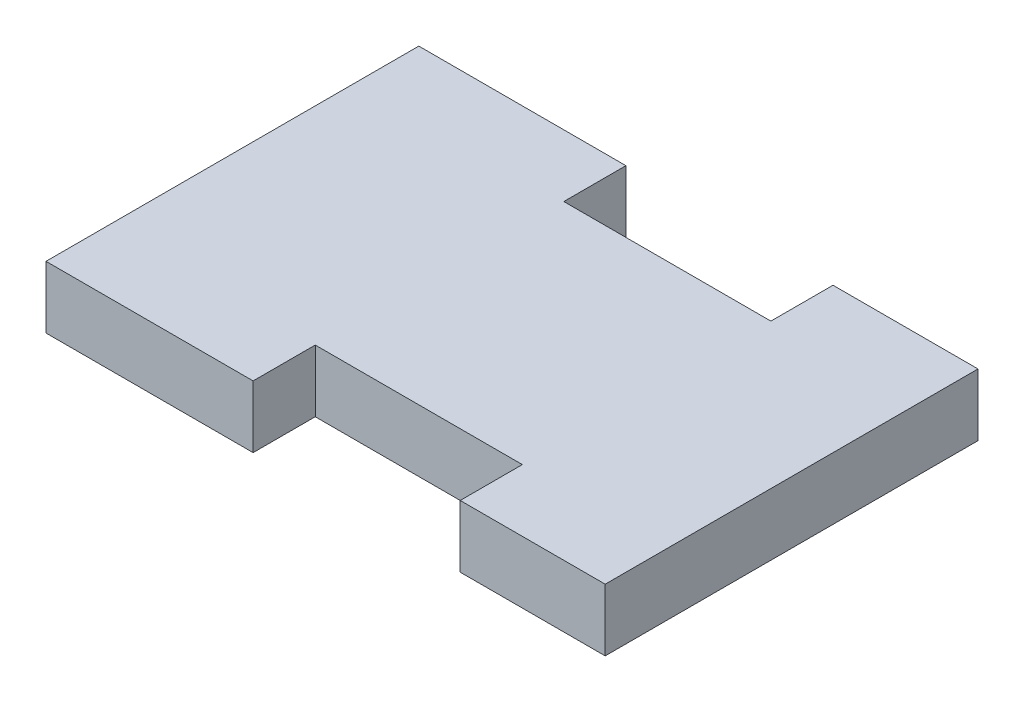
ISO-10303-21;
HEADER;
FILE_DESCRIPTION(('STEP AP214'),'2;1');
FILE_NAME('part.step','',(''),(''),'','','');
FILE_SCHEMA(('AUTOMOTIVE_DESIGN { 1 0 10303 214 1 1 1 1 }'));
ENDSEC;
DATA;
#1=APPLICATION_CONTEXT('core data for automotive mechanical design processes');
#2=APPLICATION_PROTOCOL_DEFINITION('international standard','automotive_design',2000,#1);
#3=PRODUCT_CONTEXT('',#1,'mechanical');
#4=PRODUCT('Part','Part','',(#3));
#5=PRODUCT_RELATED_PRODUCT_CATEGORY('part','',(#4));
#6=PRODUCT_DEFINITION_FORMATION('','',#4);
#7=PRODUCT_DEFINITION_CONTEXT('part definition',#1,'design');
#8=PRODUCT_DEFINITION('design','',#6,#7);
#9=PRODUCT_DEFINITION_SHAPE('','',#8);
#10=(LENGTH_UNIT() NAMED_UNIT(*) SI_UNIT(.MILLI.,.METRE.));
#11=(NAMED_UNIT(*) PLANE_ANGLE_UNIT() SI_UNIT($,.RADIAN.));
#12=(NAMED_UNIT(*) SI_UNIT($,.STERADIAN.) SOLID_ANGLE_UNIT());
#13=UNCERTAINTY_MEASURE_WITH_UNIT(LENGTH_MEASURE(1.E-05),#10,'distance_accuracy_value','');
#14=(GEOMETRIC_REPRESENTATION_CONTEXT(3) GLOBAL_UNCERTAINTY_ASSIGNED_CONTEXT((#13)) GLOBAL_UNIT_ASSIGNED_CONTEXT((#10,
#11,#12)) REPRESENTATION_CONTEXT('',''));
#15=CARTESIAN_POINT('',(0.,0.,0.));
#16=DIRECTION('',(0.,0.,1.));
#17=DIRECTION('',(1.,0.,0.));
#18=AXIS2_PLACEMENT_3D('',#15,#16,#17);
#19=CARTESIAN_POINT('',(0.,3.,0.));
#20=DIRECTION('',(1.,0.,0.));
#21=DIRECTION('',(0.,0.,-1.));
#22=AXIS2_PLACEMENT_3D('',#19,#20,#21);
#23=PLANE('',#22);
#24=DIRECTION('',(0.,0.,1.));
#25=VECTOR('',#24,1.);
#26=CARTESIAN_POINT('',(0.,0.,0.));
#27=LINE('',#26,#25);
#28=CARTESIAN_POINT('',(0.,0.,-17.999964));
#29=VERTEX_POINT('',#28);
#30=CARTESIAN_POINT('',(0.,0.,0.));
#31=VERTEX_POINT('',#30);
#32=EDGE_CURVE('E152',#29,#31,#27,.T.);
#33=ORIENTED_EDGE('',*,*,#32,.T.);
#34=DIRECTION('',(0.,-1.,0.));
#35=VECTOR('',#34,1.);
#36=CARTESIAN_POINT('',(0.,3.,0.));
#37=LINE('',#36,#35);
#38=CARTESIAN_POINT('',(0.,3.,0.));
#39=VERTEX_POINT('',#38);
#40=EDGE_CURVE('E11',#39,#31,#37,.T.);
#41=ORIENTED_EDGE('',*,*,#40,.F.);
#42=DIRECTION('',(0.,0.,1.));
#43=VECTOR('',#42,1.);
#44=CARTESIAN_POINT('',(0.,3.,0.));
#45=LINE('',#44,#43);
#46=CARTESIAN_POINT('',(0.,3.,-17.999964));
#47=VERTEX_POINT('',#46);
#48=EDGE_CURVE('E174',#47,#39,#45,.T.);
#49=ORIENTED_EDGE('',*,*,#48,.F.);
#50=DIRECTION('',(0.,-1.,0.));
#51=VECTOR('',#50,1.);
#52=CARTESIAN_POINT('',(0.,3.,-17.999964));
#53=LINE('',#52,#51);
#54=EDGE_CURVE('E148',#47,#29,#53,.T.);
#55=ORIENTED_EDGE('',*,*,#54,.T.);
#56=EDGE_LOOP('',(#33,#41,#49,#55));
#57=FACE_BOUND('',#56,.T.);
#58=ADVANCED_FACE('F32',(#57),#23,.F.);
#59=CARTESIAN_POINT('',(0.,3.,0.));
#60=DIRECTION('',(0.,0.,-1.));
#61=DIRECTION('',(-1.,0.,0.));
#62=AXIS2_PLACEMENT_3D('',#59,#60,#61);
#63=PLANE('',#62);
#64=DIRECTION('',(1.,0.,0.));
#65=VECTOR('',#64,1.);
#66=CARTESIAN_POINT('',(0.,0.,0.));
#67=LINE('',#66,#65);
#68=CARTESIAN_POINT('',(10.000234,0.,0.));
#69=VERTEX_POINT('',#68);
#70=EDGE_CURVE('E155',#31,#69,#67,.T.);
#71=ORIENTED_EDGE('',*,*,#70,.T.);
#72=DIRECTION('',(0.,-1.,0.));
#73=VECTOR('',#72,1.);
#74=CARTESIAN_POINT('',(10.000234,3.,0.));
#75=LINE('',#74,#73);
#76=CARTESIAN_POINT('',(10.000234,3.,0.));
#77=VERTEX_POINT('',#76);
#78=EDGE_CURVE('E40',#77,#69,#75,.T.);
#79=ORIENTED_EDGE('',*,*,#78,.F.);
#80=DIRECTION('',(1.,0.,0.));
#81=VECTOR('',#80,1.);
#82=CARTESIAN_POINT('',(0.,3.,0.));
#83=LINE('',#82,#81);
#84=EDGE_CURVE('E103',#39,#77,#83,.T.);
#85=ORIENTED_EDGE('',*,*,#84,.F.);
#86=ORIENTED_EDGE('',*,*,#40,.T.);
#87=EDGE_LOOP('',(#71,#79,#85,#86));
#88=FACE_BOUND('',#87,.T.);
#89=ADVANCED_FACE('F252',(#88),#63,.F.);
#90=CARTESIAN_POINT('',(10.000234,3.,-2.99999400000002));
#91=DIRECTION('',(-1.,0.,0.));
#92=DIRECTION('',(0.,0.,1.));
#93=AXIS2_PLACEMENT_3D('',#90,#91,#92);
#94=PLANE('',#93);
#95=DIRECTION('',(0.,0.,-1.));
#96=VECTOR('',#95,1.);
#97=CARTESIAN_POINT('',(10.000234,0.,-2.99999400000002));
#98=LINE('',#97,#96);
#99=CARTESIAN_POINT('',(10.000234,0.,-2.99999400000002));
#100=VERTEX_POINT('',#99);
#101=EDGE_CURVE('E157',#69,#100,#98,.T.);
#102=ORIENTED_EDGE('',*,*,#101,.T.);
#103=DIRECTION('',(0.,-1.,0.));
#104=VECTOR('',#103,1.);
#105=CARTESIAN_POINT('',(10.000234,3.,-2.99999400000002));
#106=LINE('',#105,#104);
#107=CARTESIAN_POINT('',(10.000234,3.,-2.99999400000002));
#108=VERTEX_POINT('',#107);
#109=EDGE_CURVE('E193',#108,#100,#106,.T.);
#110=ORIENTED_EDGE('',*,*,#109,.F.);
#111=DIRECTION('',(0.,0.,-1.));
#112=VECTOR('',#111,1.);
#113=CARTESIAN_POINT('',(10.000234,3.,-2.99999400000002));
#114=LINE('',#113,#112);
#115=EDGE_CURVE('E201',#77,#108,#114,.T.);
#116=ORIENTED_EDGE('',*,*,#115,.F.);
#117=ORIENTED_EDGE('',*,*,#78,.T.);
#118=EDGE_LOOP('',(#102,#110,#116,#117));
#119=FACE_BOUND('',#118,.T.);
#120=ADVANCED_FACE('F199',(#119),#94,.F.);
#121=CARTESIAN_POINT('',(10.000234,3.,-2.99999400000002));
#122=DIRECTION('',(0.,0.,-1.));
#123=DIRECTION('',(-1.,0.,0.));
#124=AXIS2_PLACEMENT_3D('',#121,#122,#123);
#125=PLANE('',#124);
#126=DIRECTION('',(1.,0.,0.));
#127=VECTOR('',#126,1.);
#128=CARTESIAN_POINT('',(10.000234,0.,-2.99999400000002));
#129=LINE('',#128,#127);
#130=CARTESIAN_POINT('',(19.999198,0.,-2.99999400000002));
#131=VERTEX_POINT('',#130);
#132=EDGE_CURVE('E159',#100,#131,#129,.T.);
#133=ORIENTED_EDGE('',*,*,#132,.T.);
#134=DIRECTION('',(0.,-1.,0.));
#135=VECTOR('',#134,1.);
#136=CARTESIAN_POINT('',(19.999198,3.,-2.99999400000002));
#137=LINE('',#136,#135);
#138=CARTESIAN_POINT('',(19.999198,3.,-2.99999400000002));
#139=VERTEX_POINT('',#138);
#140=EDGE_CURVE('E190',#139,#131,#137,.T.);
#141=ORIENTED_EDGE('',*,*,#140,.F.);
#142=DIRECTION('',(1.,0.,0.));
#143=VECTOR('',#142,1.);
#144=CARTESIAN_POINT('',(10.000234,3.,-2.99999400000002));
#145=LINE('',#144,#143);
#146=EDGE_CURVE('E219',#108,#139,#145,.T.);
#147=ORIENTED_EDGE('',*,*,#146,.F.);
#148=ORIENTED_EDGE('',*,*,#109,.T.);
#149=EDGE_LOOP('',(#133,#141,#147,#148));
#150=FACE_BOUND('',#149,.T.);
#151=ADVANCED_FACE('F210',(#150),#125,.F.);
#152=CARTESIAN_POINT('',(19.999198,3.,-2.99999400000002));
#153=DIRECTION('',(1.,0.,0.));
#154=DIRECTION('',(0.,0.,-1.));
#155=AXIS2_PLACEMENT_3D('',#152,#153,#154);
#156=PLANE('',#155);
#157=DIRECTION('',(0.,0.,1.));
#158=VECTOR('',#157,1.);
#159=CARTESIAN_POINT('',(19.999198,0.,-2.99999400000002));
#160=LINE('',#159,#158);
#161=CARTESIAN_POINT('',(19.999198,0.,0.));
#162=VERTEX_POINT('',#161);
#163=EDGE_CURVE('E161',#131,#162,#160,.T.);
#164=ORIENTED_EDGE('',*,*,#163,.T.);
#165=DIRECTION('',(0.,-1.,0.));
#166=VECTOR('',#165,1.);
#167=CARTESIAN_POINT('',(19.999198,3.,0.));
#168=LINE('',#167,#166);
#169=CARTESIAN_POINT('',(19.999198,3.,0.));
#170=VERTEX_POINT('',#169);
#171=EDGE_CURVE('E187',#170,#162,#168,.T.);
#172=ORIENTED_EDGE('',*,*,#171,.F.);
#173=DIRECTION('',(0.,0.,1.));
#174=VECTOR('',#173,1.);
#175=CARTESIAN_POINT('',(19.999198,3.,-2.99999400000002));
#176=LINE('',#175,#174);
#177=EDGE_CURVE('E216',#139,#170,#176,.T.);
#178=ORIENTED_EDGE('',*,*,#177,.F.);
#179=ORIENTED_EDGE('',*,*,#140,.T.);
#180=EDGE_LOOP('',(#164,#172,#178,#179));
#181=FACE_BOUND('',#180,.T.);
#182=ADVANCED_FACE('F214',(#181),#156,.F.);
#183=CARTESIAN_POINT('',(19.999198,3.,0.));
#184=DIRECTION('',(0.,0.,-1.));
#185=DIRECTION('',(-1.,0.,0.));
#186=AXIS2_PLACEMENT_3D('',#183,#184,#185);
#187=PLANE('',#186);
#188=DIRECTION('',(1.,0.,0.));
#189=VECTOR('',#188,1.);
#190=CARTESIAN_POINT('',(19.999198,0.,0.));
#191=LINE('',#190,#189);
#192=CARTESIAN_POINT('',(26.999692,0.,0.));
#193=VERTEX_POINT('',#192);
#194=EDGE_CURVE('E163',#162,#193,#191,.T.);
#195=ORIENTED_EDGE('',*,*,#194,.T.);
#196=DIRECTION('',(0.,-1.,0.));
#197=VECTOR('',#196,1.);
#198=CARTESIAN_POINT('',(26.999692,3.,0.));
#199=LINE('',#198,#197);
#200=CARTESIAN_POINT('',(26.999692,3.,0.));
#201=VERTEX_POINT('',#200);
#202=EDGE_CURVE('E184',#201,#193,#199,.T.);
#203=ORIENTED_EDGE('',*,*,#202,.F.);
#204=DIRECTION('',(1.,0.,0.));
#205=VECTOR('',#204,1.);
#206=CARTESIAN_POINT('',(19.999198,3.,0.));
#207=LINE('',#206,#205);
#208=EDGE_CURVE('E218',#170,#201,#207,.T.);
#209=ORIENTED_EDGE('',*,*,#208,.F.);
#210=ORIENTED_EDGE('',*,*,#171,.T.);
#211=EDGE_LOOP('',(#195,#203,#209,#210));
#212=FACE_BOUND('',#211,.T.);
#213=ADVANCED_FACE('F265',(#212),#187,.F.);
#214=CARTESIAN_POINT('',(26.999692,3.,0.));
#215=DIRECTION('',(-1.,0.,0.));
#216=DIRECTION('',(0.,0.,1.));
#217=AXIS2_PLACEMENT_3D('',#214,#215,#216);
#218=PLANE('',#217);
#219=DIRECTION('',(0.,0.,-1.));
#220=VECTOR('',#219,1.);
#221=CARTESIAN_POINT('',(26.999692,0.,0.));
#222=LINE('',#221,#220);
#223=CARTESIAN_POINT('',(26.999692,0.,-17.999964));
#224=VERTEX_POINT('',#223);
#225=EDGE_CURVE('E165',#193,#224,#222,.T.);
#226=ORIENTED_EDGE('',*,*,#225,.T.);
#227=DIRECTION('',(0.,-1.,0.));
#228=VECTOR('',#227,1.);
#229=CARTESIAN_POINT('',(26.999692,3.,-17.999964));
#230=LINE('',#229,#228);
#231=CARTESIAN_POINT('',(26.999692,3.,-17.999964));
#232=VERTEX_POINT('',#231);
#233=EDGE_CURVE('E181',#232,#224,#230,.T.);
#234=ORIENTED_EDGE('',*,*,#233,.F.);
#235=DIRECTION('',(0.,0.,-1.));
#236=VECTOR('',#235,1.);
#237=CARTESIAN_POINT('',(26.999692,3.,0.));
#238=LINE('',#237,#236);
#239=EDGE_CURVE('E221',#201,#232,#238,.T.);
#240=ORIENTED_EDGE('',*,*,#239,.F.);
#241=ORIENTED_EDGE('',*,*,#202,.T.);
#242=EDGE_LOOP('',(#226,#234,#240,#241));
#243=FACE_BOUND('',#242,.T.);
#244=ADVANCED_FACE('F268',(#243),#218,.F.);
#245=CARTESIAN_POINT('',(19.999198,3.,-17.999964));
#246=DIRECTION('',(0.,0.,1.));
#247=DIRECTION('',(1.,0.,0.));
#248=AXIS2_PLACEMENT_3D('',#245,#246,#247);
#249=PLANE('',#248);
#250=DIRECTION('',(-1.,0.,0.));
#251=VECTOR('',#250,1.);
#252=CARTESIAN_POINT('',(19.999198,0.,-17.999964));
#253=LINE('',#252,#251);
#254=CARTESIAN_POINT('',(19.999198,0.,-17.999964));
#255=VERTEX_POINT('',#254);
#256=EDGE_CURVE('E167',#224,#255,#253,.T.);
#257=ORIENTED_EDGE('',*,*,#256,.T.);
#258=DIRECTION('',(0.,-1.,0.));
#259=VECTOR('',#258,1.);
#260=CARTESIAN_POINT('',(19.999198,3.,-17.999964));
#261=LINE('',#260,#259);
#262=CARTESIAN_POINT('',(19.999198,3.,-17.999964));
#263=VERTEX_POINT('',#262);
#264=EDGE_CURVE('E178',#263,#255,#261,.T.);
#265=ORIENTED_EDGE('',*,*,#264,.F.);
#266=DIRECTION('',(-1.,0.,0.));
#267=VECTOR('',#266,1.);
#268=CARTESIAN_POINT('',(19.999198,3.,-17.999964));
#269=LINE('',#268,#267);
#270=EDGE_CURVE('E227',#232,#263,#269,.T.);
#271=ORIENTED_EDGE('',*,*,#270,.F.);
#272=ORIENTED_EDGE('',*,*,#233,.T.);
#273=EDGE_LOOP('',(#257,#265,#271,#272));
#274=FACE_BOUND('',#273,.T.);
#275=ADVANCED_FACE('F233',(#274),#249,.F.);
#276=CARTESIAN_POINT('',(19.999198,3.,-17.999964));
#277=DIRECTION('',(1.,0.,0.));
#278=DIRECTION('',(0.,0.,-1.));
#279=AXIS2_PLACEMENT_3D('',#276,#277,#278);
#280=PLANE('',#279);
#281=DIRECTION('',(0.,0.,1.));
#282=VECTOR('',#281,1.);
#283=CARTESIAN_POINT('',(19.999198,0.,-17.999964));
#284=LINE('',#283,#282);
#285=CARTESIAN_POINT('',(19.999198,0.,-14.99997));
#286=VERTEX_POINT('',#285);
#287=EDGE_CURVE('E169',#255,#286,#284,.T.);
#288=ORIENTED_EDGE('',*,*,#287,.T.);
#289=DIRECTION('',(0.,-1.,0.));
#290=VECTOR('',#289,1.);
#291=CARTESIAN_POINT('',(19.999198,3.,-14.99997));
#292=LINE('',#291,#290);
#293=CARTESIAN_POINT('',(19.999198,3.,-14.99997));
#294=VERTEX_POINT('',#293);
#295=EDGE_CURVE('E143',#294,#286,#292,.T.);
#296=ORIENTED_EDGE('',*,*,#295,.F.);
#297=DIRECTION('',(0.,0.,1.));
#298=VECTOR('',#297,1.);
#299=CARTESIAN_POINT('',(19.999198,3.,-17.999964));
#300=LINE('',#299,#298);
#301=EDGE_CURVE('E134',#263,#294,#300,.T.);
#302=ORIENTED_EDGE('',*,*,#301,.F.);
#303=ORIENTED_EDGE('',*,*,#264,.T.);
#304=EDGE_LOOP('',(#288,#296,#302,#303));
#305=FACE_BOUND('',#304,.T.);
#306=ADVANCED_FACE('F237',(#305),#280,.F.);
#307=CARTESIAN_POINT('',(10.000234,3.,-14.99997));
#308=DIRECTION('',(0.,0.,1.));
#309=DIRECTION('',(1.,0.,0.));
#310=AXIS2_PLACEMENT_3D('',#307,#308,#309);
#311=PLANE('',#310);
#312=DIRECTION('',(-1.,0.,0.));
#313=VECTOR('',#312,1.);
#314=CARTESIAN_POINT('',(10.000234,0.,-14.99997));
#315=LINE('',#314,#313);
#316=CARTESIAN_POINT('',(10.000234,0.,-14.99997));
#317=VERTEX_POINT('',#316);
#318=EDGE_CURVE('E142',#286,#317,#315,.T.);
#319=ORIENTED_EDGE('',*,*,#318,.T.);
#320=DIRECTION('',(0.,-1.,0.));
#321=VECTOR('',#320,1.);
#322=CARTESIAN_POINT('',(10.000234,3.,-14.99997));
#323=LINE('',#322,#321);
#324=CARTESIAN_POINT('',(10.000234,3.,-14.99997));
#325=VERTEX_POINT('',#324);
#326=EDGE_CURVE('E139',#325,#317,#323,.T.);
#327=ORIENTED_EDGE('',*,*,#326,.F.);
#328=DIRECTION('',(-1.,0.,0.));
#329=VECTOR('',#328,1.);
#330=CARTESIAN_POINT('',(10.000234,3.,-14.99997));
#331=LINE('',#330,#329);
#332=EDGE_CURVE('E128',#294,#325,#331,.T.);
#333=ORIENTED_EDGE('',*,*,#332,.F.);
#334=ORIENTED_EDGE('',*,*,#295,.T.);
#335=EDGE_LOOP('',(#319,#327,#333,#334));
#336=FACE_BOUND('',#335,.T.);
#337=ADVANCED_FACE('F140',(#336),#311,.F.);
#338=CARTESIAN_POINT('',(10.000234,3.,-17.999964));
#339=DIRECTION('',(-1.,0.,0.));
#340=DIRECTION('',(0.,0.,1.));
#341=AXIS2_PLACEMENT_3D('',#338,#339,#340);
#342=PLANE('',#341);
#343=DIRECTION('',(0.,0.,-1.));
#344=VECTOR('',#343,1.);
#345=CARTESIAN_POINT('',(10.000234,0.,-17.999964));
#346=LINE('',#345,#344);
#347=CARTESIAN_POINT('',(10.000234,0.,-17.999964));
#348=VERTEX_POINT('',#347);
#349=EDGE_CURVE('E89',#317,#348,#346,.T.);
#350=ORIENTED_EDGE('',*,*,#349,.T.);
#351=DIRECTION('',(0.,-1.,0.));
#352=VECTOR('',#351,1.);
#353=CARTESIAN_POINT('',(10.000234,3.,-17.999964));
#354=LINE('',#353,#352);
#355=CARTESIAN_POINT('',(10.000234,3.,-17.999964));
#356=VERTEX_POINT('',#355);
#357=EDGE_CURVE('E144',#356,#348,#354,.T.);
#358=ORIENTED_EDGE('',*,*,#357,.F.);
#359=DIRECTION('',(0.,0.,-1.));
#360=VECTOR('',#359,1.);
#361=CARTESIAN_POINT('',(10.000234,3.,-17.999964));
#362=LINE('',#361,#360);
#363=EDGE_CURVE('E132',#325,#356,#362,.T.);
#364=ORIENTED_EDGE('',*,*,#363,.F.);
#365=ORIENTED_EDGE('',*,*,#326,.T.);
#366=EDGE_LOOP('',(#350,#358,#364,#365));
#367=FACE_BOUND('',#366,.T.);
#368=ADVANCED_FACE('F146',(#367),#342,.F.);
#369=CARTESIAN_POINT('',(0.,3.,-17.999964));
#370=DIRECTION('',(0.,0.,1.));
#371=DIRECTION('',(1.,0.,0.));
#372=AXIS2_PLACEMENT_3D('',#369,#370,#371);
#373=PLANE('',#372);
#374=DIRECTION('',(-1.,0.,0.));
#375=VECTOR('',#374,1.);
#376=CARTESIAN_POINT('',(0.,0.,-17.999964));
#377=LINE('',#376,#375);
#378=EDGE_CURVE('E95',#348,#29,#377,.T.);
#379=ORIENTED_EDGE('',*,*,#378,.T.);
#380=ORIENTED_EDGE('',*,*,#54,.F.);
#381=DIRECTION('',(-1.,0.,0.));
#382=VECTOR('',#381,1.);
#383=CARTESIAN_POINT('',(0.,3.,-17.999964));
#384=LINE('',#383,#382);
#385=EDGE_CURVE('E48',#356,#47,#384,.T.);
#386=ORIENTED_EDGE('',*,*,#385,.F.);
#387=ORIENTED_EDGE('',*,*,#357,.T.);
#388=EDGE_LOOP('',(#379,#380,#386,#387));
#389=FACE_BOUND('',#388,.T.);
#390=ADVANCED_FACE('F241',(#389),#373,.F.);
#391=CARTESIAN_POINT('',(0.,3.,0.));
#392=DIRECTION('',(0.,-1.,0.));
#393=DIRECTION('',(0.,0.,-1.));
#394=AXIS2_PLACEMENT_3D('',#391,#392,#393);
#395=PLANE('',#394);
#396=ORIENTED_EDGE('',*,*,#48,.T.);
#397=ORIENTED_EDGE('',*,*,#84,.T.);
#398=ORIENTED_EDGE('',*,*,#115,.T.);
#399=ORIENTED_EDGE('',*,*,#146,.T.);
#400=ORIENTED_EDGE('',*,*,#177,.T.);
#401=ORIENTED_EDGE('',*,*,#208,.T.);
#402=ORIENTED_EDGE('',*,*,#239,.T.);
#403=ORIENTED_EDGE('',*,*,#270,.T.);
#404=ORIENTED_EDGE('',*,*,#301,.T.);
#405=ORIENTED_EDGE('',*,*,#332,.T.);
#406=ORIENTED_EDGE('',*,*,#363,.T.);
#407=ORIENTED_EDGE('',*,*,#385,.T.);
#408=EDGE_LOOP('',(#396,#397,#398,#399,#400,#401,#402,#403,#404,#405,#406,#407));
#409=FACE_BOUND('',#408,.T.);
#410=ADVANCED_FACE('F130',(#409),#395,.F.);
#411=CARTESIAN_POINT('',(0.,0.,0.));
#412=DIRECTION('',(0.,-1.,0.));
#413=DIRECTION('',(0.,0.,-1.));
#414=AXIS2_PLACEMENT_3D('',#411,#412,#413);
#415=PLANE('',#414);
#416=ORIENTED_EDGE('',*,*,#32,.F.);
#417=ORIENTED_EDGE('',*,*,#378,.F.);
#418=ORIENTED_EDGE('',*,*,#349,.F.);
#419=ORIENTED_EDGE('',*,*,#318,.F.);
#420=ORIENTED_EDGE('',*,*,#287,.F.);
#421=ORIENTED_EDGE('',*,*,#256,.F.);
#422=ORIENTED_EDGE('',*,*,#225,.F.);
#423=ORIENTED_EDGE('',*,*,#194,.F.);
#424=ORIENTED_EDGE('',*,*,#163,.F.);
#425=ORIENTED_EDGE('',*,*,#132,.F.);
#426=ORIENTED_EDGE('',*,*,#101,.F.);
#427=ORIENTED_EDGE('',*,*,#70,.F.);
#428=EDGE_LOOP('',(#416,#417,#418,#419,#420,#421,#422,#423,#424,#425,#426,#427));
#429=FACE_BOUND('',#428,.T.);
#430=ADVANCED_FACE('F205',(#429),#415,.T.);
#431=CLOSED_SHELL('',(#58,#89,#120,#151,#182,#213,#244,#275,#306,#337,#368,#390,#410,#430));
#432=MANIFOLD_SOLID_BREP('B2',#431);
#433=ADVANCED_BREP_SHAPE_REPRESENTATION('',(#18,#432),#14);
#434=SHAPE_DEFINITION_REPRESENTATION(#9,#433);
ENDSEC;
END-ISO-10303-21;
